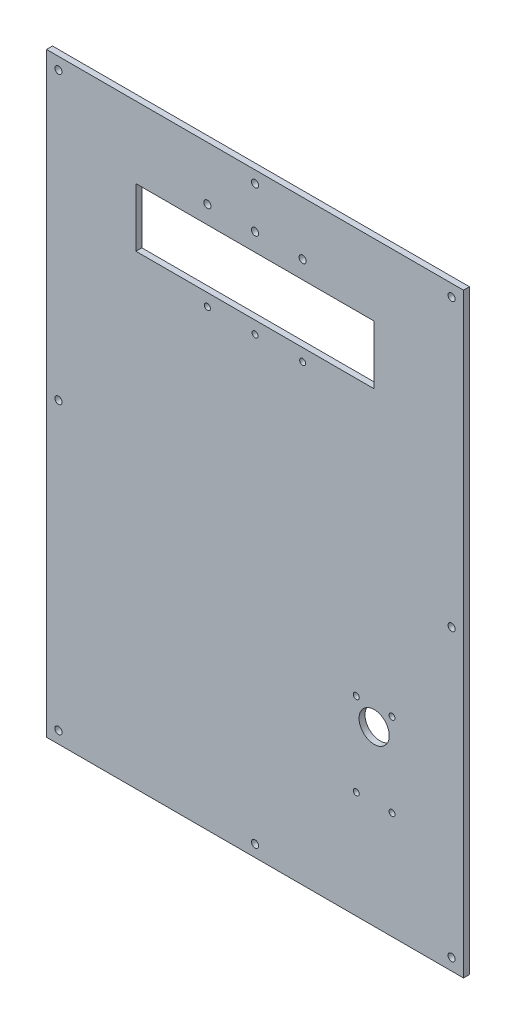
ISO-10303-21;
HEADER;
FILE_DESCRIPTION(('STEP AP214'),'2;1');
FILE_NAME('part.step','',(''),(''),'','','');
FILE_SCHEMA(('AUTOMOTIVE_DESIGN { 1 0 10303 214 1 1 1 1 }'));
ENDSEC;
DATA;
#1=APPLICATION_CONTEXT('core data for automotive mechanical design processes');
#2=APPLICATION_PROTOCOL_DEFINITION('international standard','automotive_design',2000,#1);
#3=PRODUCT_CONTEXT('',#1,'mechanical');
#4=PRODUCT('Part','Part','',(#3));
#5=PRODUCT_RELATED_PRODUCT_CATEGORY('part','',(#4));
#6=PRODUCT_DEFINITION_FORMATION('','',#4);
#7=PRODUCT_DEFINITION_CONTEXT('part definition',#1,'design');
#8=PRODUCT_DEFINITION('design','',#6,#7);
#9=PRODUCT_DEFINITION_SHAPE('','',#8);
#10=(LENGTH_UNIT() NAMED_UNIT(*) SI_UNIT(.MILLI.,.METRE.));
#11=(NAMED_UNIT(*) PLANE_ANGLE_UNIT() SI_UNIT($,.RADIAN.));
#12=(NAMED_UNIT(*) SI_UNIT($,.STERADIAN.) SOLID_ANGLE_UNIT());
#13=UNCERTAINTY_MEASURE_WITH_UNIT(LENGTH_MEASURE(1.E-05),#10,'distance_accuracy_value','');
#14=(GEOMETRIC_REPRESENTATION_CONTEXT(3) GLOBAL_UNCERTAINTY_ASSIGNED_CONTEXT((#13)) GLOBAL_UNIT_ASSIGNED_CONTEXT((#10,
#11,#12)) REPRESENTATION_CONTEXT('',''));
#15=CARTESIAN_POINT('',(0.,0.,0.));
#16=DIRECTION('',(0.,0.,1.));
#17=DIRECTION('',(1.,0.,0.));
#18=AXIS2_PLACEMENT_3D('',#15,#16,#17);
#19=CARTESIAN_POINT('',(0.,0.,5.));
#20=DIRECTION('',(0.,0.,-1.));
#21=DIRECTION('',(-1.,0.,0.));
#22=AXIS2_PLACEMENT_3D('',#19,#20,#21);
#23=PLANE('',#22);
#24=CARTESIAN_POINT('',(0.,-240.,5.));
#25=DIRECTION('',(0.,0.,1.));
#26=DIRECTION('',(1.,0.,0.));
#27=AXIS2_PLACEMENT_3D('',#24,#25,#26);
#28=CIRCLE('',#27,3.);
#29=CARTESIAN_POINT('',(3.00000000000006,-240.,5.));
#30=VERTEX_POINT('',#29);
#31=EDGE_CURVE('E140',#30,#30,#28,.T.);
#32=ORIENTED_EDGE('',*,*,#31,.F.);
#33=EDGE_LOOP('',(#32));
#34=FACE_BOUND('',#33,.T.);
#35=CARTESIAN_POINT('',(0.,240.,5.));
#36=DIRECTION('',(0.,0.,1.));
#37=DIRECTION('',(1.,0.,0.));
#38=AXIS2_PLACEMENT_3D('',#35,#36,#37);
#39=CIRCLE('',#38,3.);
#40=CARTESIAN_POINT('',(3.,240.,5.));
#41=VERTEX_POINT('',#40);
#42=EDGE_CURVE('E146',#41,#41,#39,.T.);
#43=ORIENTED_EDGE('',*,*,#42,.F.);
#44=EDGE_LOOP('',(#43));
#45=FACE_BOUND('',#44,.T.);
#46=CARTESIAN_POINT('',(165.,240.,5.));
#47=DIRECTION('',(0.,0.,1.));
#48=DIRECTION('',(-1.,0.,0.));
#49=AXIS2_PLACEMENT_3D('',#46,#47,#48);
#50=CIRCLE('',#49,2.99999999999999);
#51=CARTESIAN_POINT('',(162.,240.,5.));
#52=VERTEX_POINT('',#51);
#53=EDGE_CURVE('E152',#52,#52,#50,.T.);
#54=ORIENTED_EDGE('',*,*,#53,.F.);
#55=EDGE_LOOP('',(#54));
#56=FACE_BOUND('',#55,.T.);
#57=CARTESIAN_POINT('',(165.,0.,5.));
#58=DIRECTION('',(0.,0.,1.));
#59=DIRECTION('',(-1.,0.,0.));
#60=AXIS2_PLACEMENT_3D('',#57,#58,#59);
#61=CIRCLE('',#60,2.99999999999999);
#62=CARTESIAN_POINT('',(162.,0.,5.));
#63=VERTEX_POINT('',#62);
#64=EDGE_CURVE('E158',#63,#63,#61,.T.);
#65=ORIENTED_EDGE('',*,*,#64,.F.);
#66=EDGE_LOOP('',(#65));
#67=FACE_BOUND('',#66,.T.);
#68=CARTESIAN_POINT('',(165.,-240.,5.));
#69=DIRECTION('',(0.,0.,1.));
#70=DIRECTION('',(-1.,0.,0.));
#71=AXIS2_PLACEMENT_3D('',#68,#69,#70);
#72=CIRCLE('',#71,2.99999999999999);
#73=CARTESIAN_POINT('',(162.,-240.,5.));
#74=VERTEX_POINT('',#73);
#75=EDGE_CURVE('E164',#74,#74,#72,.T.);
#76=ORIENTED_EDGE('',*,*,#75,.F.);
#77=EDGE_LOOP('',(#76));
#78=FACE_BOUND('',#77,.T.);
#79=CARTESIAN_POINT('',(-165.,0.,5.));
#80=DIRECTION('',(0.,0.,1.));
#81=DIRECTION('',(1.,0.,0.));
#82=AXIS2_PLACEMENT_3D('',#79,#80,#81);
#83=CIRCLE('',#82,2.99999999999999);
#84=CARTESIAN_POINT('',(-162.,0.,5.));
#85=VERTEX_POINT('',#84);
#86=EDGE_CURVE('E170',#85,#85,#83,.T.);
#87=ORIENTED_EDGE('',*,*,#86,.F.);
#88=EDGE_LOOP('',(#87));
#89=FACE_BOUND('',#88,.T.);
#90=CARTESIAN_POINT('',(-165.,-240.,5.));
#91=DIRECTION('',(0.,0.,1.));
#92=DIRECTION('',(1.,0.,0.));
#93=AXIS2_PLACEMENT_3D('',#90,#91,#92);
#94=CIRCLE('',#93,2.99999999999999);
#95=CARTESIAN_POINT('',(-162.,-240.,5.));
#96=VERTEX_POINT('',#95);
#97=EDGE_CURVE('E176',#96,#96,#94,.T.);
#98=ORIENTED_EDGE('',*,*,#97,.F.);
#99=EDGE_LOOP('',(#98));
#100=FACE_BOUND('',#99,.T.);
#101=CARTESIAN_POINT('',(-165.,240.,5.));
#102=DIRECTION('',(0.,0.,1.));
#103=DIRECTION('',(1.,0.,0.));
#104=AXIS2_PLACEMENT_3D('',#101,#102,#103);
#105=CIRCLE('',#104,2.99999999999999);
#106=CARTESIAN_POINT('',(-162.,240.,5.));
#107=VERTEX_POINT('',#106);
#108=EDGE_CURVE('E182',#107,#107,#105,.T.);
#109=ORIENTED_EDGE('',*,*,#108,.F.);
#110=EDGE_LOOP('',(#109));
#111=FACE_BOUND('',#110,.T.);
#112=DIRECTION('',(0.,1.,0.));
#113=VECTOR('',#112,1.);
#114=CARTESIAN_POINT('',(175.,-250.,5.));
#115=LINE('',#114,#113);
#116=CARTESIAN_POINT('',(175.,-250.,5.));
#117=VERTEX_POINT('',#116);
#118=CARTESIAN_POINT('',(175.,250.,5.));
#119=VERTEX_POINT('',#118);
#120=EDGE_CURVE('E188',#117,#119,#115,.T.);
#121=ORIENTED_EDGE('',*,*,#120,.T.);
#122=DIRECTION('',(-1.,0.,0.));
#123=VECTOR('',#122,1.);
#124=CARTESIAN_POINT('',(-175.,250.,5.));
#125=LINE('',#124,#123);
#126=CARTESIAN_POINT('',(-175.,250.,5.));
#127=VERTEX_POINT('',#126);
#128=EDGE_CURVE('E191',#119,#127,#125,.T.);
#129=ORIENTED_EDGE('',*,*,#128,.T.);
#130=DIRECTION('',(0.,-1.,0.));
#131=VECTOR('',#130,1.);
#132=CARTESIAN_POINT('',(-175.,-250.,5.));
#133=LINE('',#132,#131);
#134=CARTESIAN_POINT('',(-175.,-250.,5.));
#135=VERTEX_POINT('',#134);
#136=EDGE_CURVE('E194',#127,#135,#133,.T.);
#137=ORIENTED_EDGE('',*,*,#136,.T.);
#138=DIRECTION('',(1.,0.,0.));
#139=VECTOR('',#138,1.);
#140=CARTESIAN_POINT('',(-175.,-250.,5.));
#141=LINE('',#140,#139);
#142=EDGE_CURVE('E196',#135,#117,#141,.T.);
#143=ORIENTED_EDGE('',*,*,#142,.T.);
#144=EDGE_LOOP('',(#121,#129,#137,#143));
#145=FACE_BOUND('',#144,.T.);
#146=DIRECTION('',(0.,-1.,0.));
#147=VECTOR('',#146,1.);
#148=CARTESIAN_POINT('',(-100.,190.,5.));
#149=LINE('',#148,#147);
#150=CARTESIAN_POINT('',(-100.,190.,5.));
#151=VERTEX_POINT('',#150);
#152=CARTESIAN_POINT('',(-100.,140.8,5.));
#153=VERTEX_POINT('',#152);
#154=EDGE_CURVE('E101',#151,#153,#149,.T.);
#155=ORIENTED_EDGE('',*,*,#154,.F.);
#156=DIRECTION('',(-1.,0.,0.));
#157=VECTOR('',#156,1.);
#158=CARTESIAN_POINT('',(100.,190.,5.));
#159=LINE('',#158,#157);
#160=CARTESIAN_POINT('',(100.,190.,5.));
#161=VERTEX_POINT('',#160);
#162=EDGE_CURVE('E124',#161,#151,#159,.T.);
#163=ORIENTED_EDGE('',*,*,#162,.F.);
#164=DIRECTION('',(0.,1.,0.));
#165=VECTOR('',#164,1.);
#166=CARTESIAN_POINT('',(100.,190.,5.));
#167=LINE('',#166,#165);
#168=CARTESIAN_POINT('',(100.,140.8,5.));
#169=VERTEX_POINT('',#168);
#170=EDGE_CURVE('E122',#169,#161,#167,.T.);
#171=ORIENTED_EDGE('',*,*,#170,.F.);
#172=DIRECTION('',(1.,0.,0.));
#173=VECTOR('',#172,1.);
#174=CARTESIAN_POINT('',(100.,140.8,5.));
#175=LINE('',#174,#173);
#176=EDGE_CURVE('E109',#153,#169,#175,.T.);
#177=ORIENTED_EDGE('',*,*,#176,.F.);
#178=EDGE_LOOP('',(#155,#163,#171,#177));
#179=FACE_BOUND('',#178,.T.);
#180=CARTESIAN_POINT('',(40.,205.,5.));
#181=DIRECTION('',(0.,0.,1.));
#182=DIRECTION('',(1.,0.,0.));
#183=AXIS2_PLACEMENT_3D('',#180,#181,#182);
#184=CIRCLE('',#183,3.00000000000001);
#185=CARTESIAN_POINT('',(43.,205.,5.));
#186=VERTEX_POINT('',#185);
#187=EDGE_CURVE('E130',#186,#186,#184,.T.);
#188=ORIENTED_EDGE('',*,*,#187,.F.);
#189=EDGE_LOOP('',(#188));
#190=FACE_BOUND('',#189,.T.);
#191=CARTESIAN_POINT('',(0.,205.,5.));
#192=DIRECTION('',(0.,0.,1.));
#193=DIRECTION('',(1.,0.,0.));
#194=AXIS2_PLACEMENT_3D('',#191,#192,#193);
#195=CIRCLE('',#194,3.);
#196=CARTESIAN_POINT('',(3.,205.,5.));
#197=VERTEX_POINT('',#196);
#198=EDGE_CURVE('E343',#197,#197,#195,.T.);
#199=ORIENTED_EDGE('',*,*,#198,.F.);
#200=EDGE_LOOP('',(#199));
#201=FACE_BOUND('',#200,.T.);
#202=CARTESIAN_POINT('',(-40.,205.,5.));
#203=DIRECTION('',(0.,0.,1.));
#204=DIRECTION('',(-1.,0.,0.));
#205=AXIS2_PLACEMENT_3D('',#202,#203,#204);
#206=CIRCLE('',#205,3.00000000000001);
#207=CARTESIAN_POINT('',(-43.,205.,5.));
#208=VERTEX_POINT('',#207);
#209=EDGE_CURVE('E338',#208,#208,#206,.T.);
#210=ORIENTED_EDGE('',*,*,#209,.F.);
#211=EDGE_LOOP('',(#210));
#212=FACE_BOUND('',#211,.T.);
#213=CARTESIAN_POINT('',(0.,130.4,5.));
#214=DIRECTION('',(0.,0.,1.));
#215=DIRECTION('',(1.,0.,0.));
#216=AXIS2_PLACEMENT_3D('',#213,#214,#215);
#217=CIRCLE('',#216,2.5);
#218=CARTESIAN_POINT('',(2.5,130.4,5.));
#219=VERTEX_POINT('',#218);
#220=EDGE_CURVE('E333',#219,#219,#217,.T.);
#221=ORIENTED_EDGE('',*,*,#220,.F.);
#222=EDGE_LOOP('',(#221));
#223=FACE_BOUND('',#222,.T.);
#224=CARTESIAN_POINT('',(40.,130.4,5.));
#225=DIRECTION('',(0.,0.,1.));
#226=DIRECTION('',(1.,0.,0.));
#227=AXIS2_PLACEMENT_3D('',#224,#225,#226);
#228=CIRCLE('',#227,2.5);
#229=CARTESIAN_POINT('',(42.5,130.4,5.));
#230=VERTEX_POINT('',#229);
#231=EDGE_CURVE('E328',#230,#230,#228,.T.);
#232=ORIENTED_EDGE('',*,*,#231,.F.);
#233=EDGE_LOOP('',(#232));
#234=FACE_BOUND('',#233,.T.);
#235=CARTESIAN_POINT('',(-40.,130.4,5.));
#236=DIRECTION('',(0.,0.,1.));
#237=DIRECTION('',(-1.,0.,0.));
#238=AXIS2_PLACEMENT_3D('',#235,#236,#237);
#239=CIRCLE('',#238,2.5);
#240=CARTESIAN_POINT('',(-42.5,130.4,5.));
#241=VERTEX_POINT('',#240);
#242=EDGE_CURVE('E323',#241,#241,#239,.T.);
#243=ORIENTED_EDGE('',*,*,#242,.F.);
#244=EDGE_LOOP('',(#243));
#245=FACE_BOUND('',#244,.T.);
#246=CARTESIAN_POINT('',(115.,-90.0000000000001,5.));
#247=DIRECTION('',(0.,0.,1.));
#248=DIRECTION('',(1.,0.,0.));
#249=AXIS2_PLACEMENT_3D('',#246,#247,#248);
#250=CIRCLE('',#249,2.50000000000001);
#251=CARTESIAN_POINT('',(117.5,-90.0000000000001,5.));
#252=VERTEX_POINT('',#251);
#253=EDGE_CURVE('E318',#252,#252,#250,.T.);
#254=ORIENTED_EDGE('',*,*,#253,.F.);
#255=EDGE_LOOP('',(#254));
#256=FACE_BOUND('',#255,.T.);
#257=CARTESIAN_POINT('',(85.0000000000001,-90.0000000000001,5.));
#258=DIRECTION('',(0.,0.,1.));
#259=DIRECTION('',(1.,0.,0.));
#260=AXIS2_PLACEMENT_3D('',#257,#258,#259);
#261=CIRCLE('',#260,2.50000000000001);
#262=CARTESIAN_POINT('',(87.5000000000001,-90.0000000000001,5.));
#263=VERTEX_POINT('',#262);
#264=EDGE_CURVE('E313',#263,#263,#261,.T.);
#265=ORIENTED_EDGE('',*,*,#264,.F.);
#266=EDGE_LOOP('',(#265));
#267=FACE_BOUND('',#266,.T.);
#268=CARTESIAN_POINT('',(115.,-160.,5.));
#269=DIRECTION('',(0.,0.,1.));
#270=DIRECTION('',(1.,0.,0.));
#271=AXIS2_PLACEMENT_3D('',#268,#269,#270);
#272=CIRCLE('',#271,2.50000000000001);
#273=CARTESIAN_POINT('',(117.5,-160.,5.));
#274=VERTEX_POINT('',#273);
#275=EDGE_CURVE('E308',#274,#274,#272,.T.);
#276=ORIENTED_EDGE('',*,*,#275,.F.);
#277=EDGE_LOOP('',(#276));
#278=FACE_BOUND('',#277,.T.);
#279=CARTESIAN_POINT('',(85.0000000000001,-160.,5.));
#280=DIRECTION('',(0.,0.,1.));
#281=DIRECTION('',(1.,0.,0.));
#282=AXIS2_PLACEMENT_3D('',#279,#280,#281);
#283=CIRCLE('',#282,2.5);
#284=CARTESIAN_POINT('',(87.5000000000001,-160.,5.));
#285=VERTEX_POINT('',#284);
#286=EDGE_CURVE('E303',#285,#285,#283,.T.);
#287=ORIENTED_EDGE('',*,*,#286,.F.);
#288=EDGE_LOOP('',(#287));
#289=FACE_BOUND('',#288,.T.);
#290=CARTESIAN_POINT('',(100.,-105.,5.));
#291=DIRECTION('',(0.,0.,1.));
#292=DIRECTION('',(1.,0.,0.));
#293=AXIS2_PLACEMENT_3D('',#290,#291,#292);
#294=CIRCLE('',#293,12.665);
#295=CARTESIAN_POINT('',(112.665,-105.,5.));
#296=VERTEX_POINT('',#295);
#297=EDGE_CURVE('E297',#296,#296,#294,.T.);
#298=ORIENTED_EDGE('',*,*,#297,.F.);
#299=EDGE_LOOP('',(#298));
#300=FACE_BOUND('',#299,.T.);
#301=ADVANCED_FACE('F36',(#34,#45,#56,#67,#78,#89,#100,#111,#145,#179,#190,#201,#212,#223,#234,
#245,#256,#267,#278,#289,#300),#23,.F.);
#302=CARTESIAN_POINT('',(0.,0.,0.));
#303=DIRECTION('',(0.,0.,-1.));
#304=DIRECTION('',(-1.,0.,0.));
#305=AXIS2_PLACEMENT_3D('',#302,#303,#304);
#306=PLANE('',#305);
#307=CARTESIAN_POINT('',(85.0000000000001,-160.,0.));
#308=DIRECTION('',(0.,0.,1.));
#309=DIRECTION('',(1.,0.,0.));
#310=AXIS2_PLACEMENT_3D('',#307,#308,#309);
#311=CIRCLE('',#310,2.5);
#312=CARTESIAN_POINT('',(87.5000000000001,-160.,0.));
#313=VERTEX_POINT('',#312);
#314=EDGE_CURVE('E300',#313,#313,#311,.T.);
#315=ORIENTED_EDGE('',*,*,#314,.T.);
#316=EDGE_LOOP('',(#315));
#317=FACE_BOUND('',#316,.T.);
#318=CARTESIAN_POINT('',(85.0000000000001,-90.0000000000001,0.));
#319=DIRECTION('',(0.,0.,1.));
#320=DIRECTION('',(1.,0.,0.));
#321=AXIS2_PLACEMENT_3D('',#318,#319,#320);
#322=CIRCLE('',#321,2.50000000000001);
#323=CARTESIAN_POINT('',(87.5000000000001,-90.0000000000001,0.));
#324=VERTEX_POINT('',#323);
#325=EDGE_CURVE('E311',#324,#324,#322,.T.);
#326=ORIENTED_EDGE('',*,*,#325,.T.);
#327=EDGE_LOOP('',(#326));
#328=FACE_BOUND('',#327,.T.);
#329=CARTESIAN_POINT('',(-40.,130.4,0.));
#330=DIRECTION('',(0.,0.,1.));
#331=DIRECTION('',(-1.,0.,0.));
#332=AXIS2_PLACEMENT_3D('',#329,#330,#331);
#333=CIRCLE('',#332,2.5);
#334=CARTESIAN_POINT('',(-42.5,130.4,0.));
#335=VERTEX_POINT('',#334);
#336=EDGE_CURVE('E321',#335,#335,#333,.T.);
#337=ORIENTED_EDGE('',*,*,#336,.T.);
#338=EDGE_LOOP('',(#337));
#339=FACE_BOUND('',#338,.T.);
#340=CARTESIAN_POINT('',(0.,130.4,0.));
#341=DIRECTION('',(0.,0.,1.));
#342=DIRECTION('',(1.,0.,0.));
#343=AXIS2_PLACEMENT_3D('',#340,#341,#342);
#344=CIRCLE('',#343,2.5);
#345=CARTESIAN_POINT('',(2.5,130.4,0.));
#346=VERTEX_POINT('',#345);
#347=EDGE_CURVE('E331',#346,#346,#344,.T.);
#348=ORIENTED_EDGE('',*,*,#347,.T.);
#349=EDGE_LOOP('',(#348));
#350=FACE_BOUND('',#349,.T.);
#351=CARTESIAN_POINT('',(0.,205.,0.));
#352=DIRECTION('',(0.,0.,1.));
#353=DIRECTION('',(1.,0.,0.));
#354=AXIS2_PLACEMENT_3D('',#351,#352,#353);
#355=CIRCLE('',#354,3.);
#356=CARTESIAN_POINT('',(3.,205.,0.));
#357=VERTEX_POINT('',#356);
#358=EDGE_CURVE('E341',#357,#357,#355,.T.);
#359=ORIENTED_EDGE('',*,*,#358,.T.);
#360=EDGE_LOOP('',(#359));
#361=FACE_BOUND('',#360,.T.);
#362=DIRECTION('',(-1.,0.,0.));
#363=VECTOR('',#362,1.);
#364=CARTESIAN_POINT('',(100.,190.,0.));
#365=LINE('',#364,#363);
#366=CARTESIAN_POINT('',(100.,190.,0.));
#367=VERTEX_POINT('',#366);
#368=CARTESIAN_POINT('',(-100.,190.,0.));
#369=VERTEX_POINT('',#368);
#370=EDGE_CURVE('E110',#367,#369,#365,.T.);
#371=ORIENTED_EDGE('',*,*,#370,.T.);
#372=DIRECTION('',(0.,-1.,0.));
#373=VECTOR('',#372,1.);
#374=CARTESIAN_POINT('',(-100.,190.,0.));
#375=LINE('',#374,#373);
#376=CARTESIAN_POINT('',(-100.,140.8,0.));
#377=VERTEX_POINT('',#376);
#378=EDGE_CURVE('E59',#369,#377,#375,.T.);
#379=ORIENTED_EDGE('',*,*,#378,.T.);
#380=DIRECTION('',(1.,0.,0.));
#381=VECTOR('',#380,1.);
#382=CARTESIAN_POINT('',(100.,140.8,0.));
#383=LINE('',#382,#381);
#384=CARTESIAN_POINT('',(100.,140.8,0.));
#385=VERTEX_POINT('',#384);
#386=EDGE_CURVE('E116',#377,#385,#383,.T.);
#387=ORIENTED_EDGE('',*,*,#386,.T.);
#388=DIRECTION('',(0.,1.,0.));
#389=VECTOR('',#388,1.);
#390=CARTESIAN_POINT('',(100.,190.,0.));
#391=LINE('',#390,#389);
#392=EDGE_CURVE('E132',#385,#367,#391,.T.);
#393=ORIENTED_EDGE('',*,*,#392,.T.);
#394=EDGE_LOOP('',(#371,#379,#387,#393));
#395=FACE_BOUND('',#394,.T.);
#396=CARTESIAN_POINT('',(0.,-240.,0.));
#397=DIRECTION('',(0.,0.,1.));
#398=DIRECTION('',(1.,0.,0.));
#399=AXIS2_PLACEMENT_3D('',#396,#397,#398);
#400=CIRCLE('',#399,3.);
#401=CARTESIAN_POINT('',(3.00000000000006,-240.,0.));
#402=VERTEX_POINT('',#401);
#403=EDGE_CURVE('E117',#402,#402,#400,.T.);
#404=ORIENTED_EDGE('',*,*,#403,.T.);
#405=EDGE_LOOP('',(#404));
#406=FACE_BOUND('',#405,.T.);
#407=CARTESIAN_POINT('',(165.,240.,0.));
#408=DIRECTION('',(0.,0.,1.));
#409=DIRECTION('',(-1.,0.,0.));
#410=AXIS2_PLACEMENT_3D('',#407,#408,#409);
#411=CIRCLE('',#410,2.99999999999999);
#412=CARTESIAN_POINT('',(162.,240.,0.));
#413=VERTEX_POINT('',#412);
#414=EDGE_CURVE('E149',#413,#413,#411,.T.);
#415=ORIENTED_EDGE('',*,*,#414,.T.);
#416=EDGE_LOOP('',(#415));
#417=FACE_BOUND('',#416,.T.);
#418=CARTESIAN_POINT('',(165.,-240.,0.));
#419=DIRECTION('',(0.,0.,1.));
#420=DIRECTION('',(-1.,0.,0.));
#421=AXIS2_PLACEMENT_3D('',#418,#419,#420);
#422=CIRCLE('',#421,2.99999999999999);
#423=CARTESIAN_POINT('',(162.,-240.,0.));
#424=VERTEX_POINT('',#423);
#425=EDGE_CURVE('E161',#424,#424,#422,.T.);
#426=ORIENTED_EDGE('',*,*,#425,.T.);
#427=EDGE_LOOP('',(#426));
#428=FACE_BOUND('',#427,.T.);
#429=CARTESIAN_POINT('',(-165.,-240.,0.));
#430=DIRECTION('',(0.,0.,1.));
#431=DIRECTION('',(1.,0.,0.));
#432=AXIS2_PLACEMENT_3D('',#429,#430,#431);
#433=CIRCLE('',#432,2.99999999999999);
#434=CARTESIAN_POINT('',(-162.,-240.,0.));
#435=VERTEX_POINT('',#434);
#436=EDGE_CURVE('E173',#435,#435,#433,.T.);
#437=ORIENTED_EDGE('',*,*,#436,.T.);
#438=EDGE_LOOP('',(#437));
#439=FACE_BOUND('',#438,.T.);
#440=DIRECTION('',(0.,1.,0.));
#441=VECTOR('',#440,1.);
#442=CARTESIAN_POINT('',(175.,-250.,0.));
#443=LINE('',#442,#441);
#444=CARTESIAN_POINT('',(175.,-250.,0.));
#445=VERTEX_POINT('',#444);
#446=CARTESIAN_POINT('',(175.,250.,0.));
#447=VERTEX_POINT('',#446);
#448=EDGE_CURVE('E185',#445,#447,#443,.T.);
#449=ORIENTED_EDGE('',*,*,#448,.F.);
#450=DIRECTION('',(1.,0.,0.));
#451=VECTOR('',#450,1.);
#452=CARTESIAN_POINT('',(-175.,-250.,0.));
#453=LINE('',#452,#451);
#454=CARTESIAN_POINT('',(-175.,-250.,0.));
#455=VERTEX_POINT('',#454);
#456=EDGE_CURVE('E192',#455,#445,#453,.T.);
#457=ORIENTED_EDGE('',*,*,#456,.F.);
#458=DIRECTION('',(0.,-1.,0.));
#459=VECTOR('',#458,1.);
#460=CARTESIAN_POINT('',(-175.,-250.,0.));
#461=LINE('',#460,#459);
#462=CARTESIAN_POINT('',(-175.,250.,0.));
#463=VERTEX_POINT('',#462);
#464=EDGE_CURVE('E203',#463,#455,#461,.T.);
#465=ORIENTED_EDGE('',*,*,#464,.F.);
#466=DIRECTION('',(-1.,0.,0.));
#467=VECTOR('',#466,1.);
#468=CARTESIAN_POINT('',(-175.,250.,0.));
#469=LINE('',#468,#467);
#470=EDGE_CURVE('E201',#447,#463,#469,.T.);
#471=ORIENTED_EDGE('',*,*,#470,.F.);
#472=EDGE_LOOP('',(#449,#457,#465,#471));
#473=FACE_BOUND('',#472,.T.);
#474=CARTESIAN_POINT('',(-165.,240.,0.));
#475=DIRECTION('',(0.,0.,1.));
#476=DIRECTION('',(1.,0.,0.));
#477=AXIS2_PLACEMENT_3D('',#474,#475,#476);
#478=CIRCLE('',#477,2.99999999999999);
#479=CARTESIAN_POINT('',(-162.,240.,0.));
#480=VERTEX_POINT('',#479);
#481=EDGE_CURVE('E179',#480,#480,#478,.T.);
#482=ORIENTED_EDGE('',*,*,#481,.T.);
#483=EDGE_LOOP('',(#482));
#484=FACE_BOUND('',#483,.T.);
#485=CARTESIAN_POINT('',(-165.,0.,0.));
#486=DIRECTION('',(0.,0.,1.));
#487=DIRECTION('',(1.,0.,0.));
#488=AXIS2_PLACEMENT_3D('',#485,#486,#487);
#489=CIRCLE('',#488,2.99999999999999);
#490=CARTESIAN_POINT('',(-162.,0.,0.));
#491=VERTEX_POINT('',#490);
#492=EDGE_CURVE('E167',#491,#491,#489,.T.);
#493=ORIENTED_EDGE('',*,*,#492,.T.);
#494=EDGE_LOOP('',(#493));
#495=FACE_BOUND('',#494,.T.);
#496=CARTESIAN_POINT('',(165.,0.,0.));
#497=DIRECTION('',(0.,0.,1.));
#498=DIRECTION('',(-1.,0.,0.));
#499=AXIS2_PLACEMENT_3D('',#496,#497,#498);
#500=CIRCLE('',#499,2.99999999999999);
#501=CARTESIAN_POINT('',(162.,0.,0.));
#502=VERTEX_POINT('',#501);
#503=EDGE_CURVE('E155',#502,#502,#500,.T.);
#504=ORIENTED_EDGE('',*,*,#503,.T.);
#505=EDGE_LOOP('',(#504));
#506=FACE_BOUND('',#505,.T.);
#507=CARTESIAN_POINT('',(0.,240.,0.));
#508=DIRECTION('',(0.,0.,1.));
#509=DIRECTION('',(1.,0.,0.));
#510=AXIS2_PLACEMENT_3D('',#507,#508,#509);
#511=CIRCLE('',#510,3.);
#512=CARTESIAN_POINT('',(3.,240.,0.));
#513=VERTEX_POINT('',#512);
#514=EDGE_CURVE('E143',#513,#513,#511,.T.);
#515=ORIENTED_EDGE('',*,*,#514,.T.);
#516=EDGE_LOOP('',(#515));
#517=FACE_BOUND('',#516,.T.);
#518=CARTESIAN_POINT('',(40.,205.,0.));
#519=DIRECTION('',(0.,0.,1.));
#520=DIRECTION('',(1.,0.,0.));
#521=AXIS2_PLACEMENT_3D('',#518,#519,#520);
#522=CIRCLE('',#521,3.00000000000001);
#523=CARTESIAN_POINT('',(43.,205.,0.));
#524=VERTEX_POINT('',#523);
#525=EDGE_CURVE('E276',#524,#524,#522,.T.);
#526=ORIENTED_EDGE('',*,*,#525,.T.);
#527=EDGE_LOOP('',(#526));
#528=FACE_BOUND('',#527,.T.);
#529=CARTESIAN_POINT('',(-40.,205.,0.));
#530=DIRECTION('',(0.,0.,1.));
#531=DIRECTION('',(-1.,0.,0.));
#532=AXIS2_PLACEMENT_3D('',#529,#530,#531);
#533=CIRCLE('',#532,3.00000000000001);
#534=CARTESIAN_POINT('',(-43.,205.,0.));
#535=VERTEX_POINT('',#534);
#536=EDGE_CURVE('E280',#535,#535,#533,.T.);
#537=ORIENTED_EDGE('',*,*,#536,.T.);
#538=EDGE_LOOP('',(#537));
#539=FACE_BOUND('',#538,.T.);
#540=CARTESIAN_POINT('',(40.,130.4,0.));
#541=DIRECTION('',(0.,0.,1.));
#542=DIRECTION('',(1.,0.,0.));
#543=AXIS2_PLACEMENT_3D('',#540,#541,#542);
#544=CIRCLE('',#543,2.5);
#545=CARTESIAN_POINT('',(42.5,130.4,0.));
#546=VERTEX_POINT('',#545);
#547=EDGE_CURVE('E284',#546,#546,#544,.T.);
#548=ORIENTED_EDGE('',*,*,#547,.T.);
#549=EDGE_LOOP('',(#548));
#550=FACE_BOUND('',#549,.T.);
#551=CARTESIAN_POINT('',(115.,-90.0000000000001,0.));
#552=DIRECTION('',(0.,0.,1.));
#553=DIRECTION('',(1.,0.,0.));
#554=AXIS2_PLACEMENT_3D('',#551,#552,#553);
#555=CIRCLE('',#554,2.50000000000001);
#556=CARTESIAN_POINT('',(117.5,-90.0000000000001,0.));
#557=VERTEX_POINT('',#556);
#558=EDGE_CURVE('E288',#557,#557,#555,.T.);
#559=ORIENTED_EDGE('',*,*,#558,.T.);
#560=EDGE_LOOP('',(#559));
#561=FACE_BOUND('',#560,.T.);
#562=CARTESIAN_POINT('',(115.,-160.,0.));
#563=DIRECTION('',(0.,0.,1.));
#564=DIRECTION('',(1.,0.,0.));
#565=AXIS2_PLACEMENT_3D('',#562,#563,#564);
#566=CIRCLE('',#565,2.50000000000001);
#567=CARTESIAN_POINT('',(117.5,-160.,0.));
#568=VERTEX_POINT('',#567);
#569=EDGE_CURVE('E292',#568,#568,#566,.T.);
#570=ORIENTED_EDGE('',*,*,#569,.T.);
#571=EDGE_LOOP('',(#570));
#572=FACE_BOUND('',#571,.T.);
#573=CARTESIAN_POINT('',(100.,-105.,0.));
#574=DIRECTION('',(0.,0.,1.));
#575=DIRECTION('',(1.,0.,0.));
#576=AXIS2_PLACEMENT_3D('',#573,#574,#575);
#577=CIRCLE('',#576,12.665);
#578=CARTESIAN_POINT('',(112.665,-105.,0.));
#579=VERTEX_POINT('',#578);
#580=EDGE_CURVE('E295',#579,#579,#577,.T.);
#581=ORIENTED_EDGE('',*,*,#580,.T.);
#582=EDGE_LOOP('',(#581));
#583=FACE_BOUND('',#582,.T.);
#584=ADVANCED_FACE('F221',(#317,#328,#339,#350,#361,#395,#406,#417,#428,#439,#473,#484,#495,
#506,#517,#528,#539,#550,#561,#572,#583),#306,.T.);
#585=CARTESIAN_POINT('',(175.,-250.,5.));
#586=DIRECTION('',(-1.,0.,0.));
#587=DIRECTION('',(0.,-1.,0.));
#588=AXIS2_PLACEMENT_3D('',#585,#586,#587);
#589=PLANE('',#588);
#590=ORIENTED_EDGE('',*,*,#448,.T.);
#591=DIRECTION('',(0.,0.,-1.));
#592=VECTOR('',#591,1.);
#593=CARTESIAN_POINT('',(175.,250.,5.));
#594=LINE('',#593,#592);
#595=EDGE_CURVE('E11',#119,#447,#594,.T.);
#596=ORIENTED_EDGE('',*,*,#595,.F.);
#597=ORIENTED_EDGE('',*,*,#120,.F.);
#598=DIRECTION('',(0.,0.,-1.));
#599=VECTOR('',#598,1.);
#600=CARTESIAN_POINT('',(175.,-250.,5.));
#601=LINE('',#600,#599);
#602=EDGE_CURVE('E198',#117,#445,#601,.T.);
#603=ORIENTED_EDGE('',*,*,#602,.T.);
#604=EDGE_LOOP('',(#590,#596,#597,#603));
#605=FACE_BOUND('',#604,.T.);
#606=ADVANCED_FACE('F38',(#605),#589,.F.);
#607=CARTESIAN_POINT('',(-175.,250.,5.));
#608=DIRECTION('',(0.,-1.,0.));
#609=DIRECTION('',(1.,0.,0.));
#610=AXIS2_PLACEMENT_3D('',#607,#608,#609);
#611=PLANE('',#610);
#612=ORIENTED_EDGE('',*,*,#470,.T.);
#613=DIRECTION('',(0.,0.,-1.));
#614=VECTOR('',#613,1.);
#615=CARTESIAN_POINT('',(-175.,250.,5.));
#616=LINE('',#615,#614);
#617=EDGE_CURVE('E44',#127,#463,#616,.T.);
#618=ORIENTED_EDGE('',*,*,#617,.F.);
#619=ORIENTED_EDGE('',*,*,#128,.F.);
#620=ORIENTED_EDGE('',*,*,#595,.T.);
#621=EDGE_LOOP('',(#612,#618,#619,#620));
#622=FACE_BOUND('',#621,.T.);
#623=ADVANCED_FACE('F231',(#622),#611,.F.);
#624=CARTESIAN_POINT('',(-175.,-250.,5.));
#625=DIRECTION('',(1.,0.,0.));
#626=DIRECTION('',(0.,0.,-1.));
#627=AXIS2_PLACEMENT_3D('',#624,#625,#626);
#628=PLANE('',#627);
#629=ORIENTED_EDGE('',*,*,#464,.T.);
#630=DIRECTION('',(0.,0.,-1.));
#631=VECTOR('',#630,1.);
#632=CARTESIAN_POINT('',(-175.,-250.,5.));
#633=LINE('',#632,#631);
#634=EDGE_CURVE('E208',#135,#455,#633,.T.);
#635=ORIENTED_EDGE('',*,*,#634,.F.);
#636=ORIENTED_EDGE('',*,*,#136,.F.);
#637=ORIENTED_EDGE('',*,*,#617,.T.);
#638=EDGE_LOOP('',(#629,#635,#636,#637));
#639=FACE_BOUND('',#638,.T.);
#640=ADVANCED_FACE('F215',(#639),#628,.F.);
#641=CARTESIAN_POINT('',(-175.,-250.,5.));
#642=DIRECTION('',(0.,1.,0.));
#643=DIRECTION('',(-1.,0.,0.));
#644=AXIS2_PLACEMENT_3D('',#641,#642,#643);
#645=PLANE('',#644);
#646=ORIENTED_EDGE('',*,*,#456,.T.);
#647=ORIENTED_EDGE('',*,*,#602,.F.);
#648=ORIENTED_EDGE('',*,*,#142,.F.);
#649=ORIENTED_EDGE('',*,*,#634,.T.);
#650=EDGE_LOOP('',(#646,#647,#648,#649));
#651=FACE_BOUND('',#650,.T.);
#652=ADVANCED_FACE('F225',(#651),#645,.F.);
#653=CARTESIAN_POINT('',(-165.,240.,5.));
#654=DIRECTION('',(0.,0.,-1.));
#655=DIRECTION('',(-1.,0.,0.));
#656=AXIS2_PLACEMENT_3D('',#653,#654,#655);
#657=CYLINDRICAL_SURFACE('',#656,2.99999999999999);
#658=ORIENTED_EDGE('',*,*,#108,.T.);
#659=EDGE_LOOP('',(#658));
#660=FACE_BOUND('',#659,.T.);
#661=ORIENTED_EDGE('',*,*,#481,.F.);
#662=EDGE_LOOP('',(#661));
#663=FACE_BOUND('',#662,.T.);
#664=ADVANCED_FACE('F249',(#660,#663),#657,.F.);
#665=CARTESIAN_POINT('',(-165.,-240.,5.));
#666=DIRECTION('',(0.,0.,-1.));
#667=DIRECTION('',(-1.,0.,0.));
#668=AXIS2_PLACEMENT_3D('',#665,#666,#667);
#669=CYLINDRICAL_SURFACE('',#668,2.99999999999999);
#670=ORIENTED_EDGE('',*,*,#97,.T.);
#671=EDGE_LOOP('',(#670));
#672=FACE_BOUND('',#671,.T.);
#673=ORIENTED_EDGE('',*,*,#436,.F.);
#674=EDGE_LOOP('',(#673));
#675=FACE_BOUND('',#674,.T.);
#676=ADVANCED_FACE('F256',(#672,#675),#669,.F.);
#677=CARTESIAN_POINT('',(-165.,0.,5.));
#678=DIRECTION('',(0.,0.,-1.));
#679=DIRECTION('',(-1.,0.,0.));
#680=AXIS2_PLACEMENT_3D('',#677,#678,#679);
#681=CYLINDRICAL_SURFACE('',#680,2.99999999999999);
#682=ORIENTED_EDGE('',*,*,#86,.T.);
#683=EDGE_LOOP('',(#682));
#684=FACE_BOUND('',#683,.T.);
#685=ORIENTED_EDGE('',*,*,#492,.F.);
#686=EDGE_LOOP('',(#685));
#687=FACE_BOUND('',#686,.T.);
#688=ADVANCED_FACE('F261',(#684,#687),#681,.F.);
#689=CARTESIAN_POINT('',(165.,-240.,5.));
#690=DIRECTION('',(0.,0.,-1.));
#691=DIRECTION('',(-1.,0.,0.));
#692=AXIS2_PLACEMENT_3D('',#689,#690,#691);
#693=CYLINDRICAL_SURFACE('',#692,2.99999999999999);
#694=ORIENTED_EDGE('',*,*,#75,.T.);
#695=EDGE_LOOP('',(#694));
#696=FACE_BOUND('',#695,.T.);
#697=ORIENTED_EDGE('',*,*,#425,.F.);
#698=EDGE_LOOP('',(#697));
#699=FACE_BOUND('',#698,.T.);
#700=ADVANCED_FACE('F444',(#696,#699),#693,.F.);
#701=CARTESIAN_POINT('',(165.,0.,5.));
#702=DIRECTION('',(0.,0.,-1.));
#703=DIRECTION('',(-1.,0.,0.));
#704=AXIS2_PLACEMENT_3D('',#701,#702,#703);
#705=CYLINDRICAL_SURFACE('',#704,2.99999999999999);
#706=ORIENTED_EDGE('',*,*,#64,.T.);
#707=EDGE_LOOP('',(#706));
#708=FACE_BOUND('',#707,.T.);
#709=ORIENTED_EDGE('',*,*,#503,.F.);
#710=EDGE_LOOP('',(#709));
#711=FACE_BOUND('',#710,.T.);
#712=ADVANCED_FACE('F440',(#708,#711),#705,.F.);
#713=CARTESIAN_POINT('',(165.,240.,5.));
#714=DIRECTION('',(0.,0.,-1.));
#715=DIRECTION('',(-1.,0.,0.));
#716=AXIS2_PLACEMENT_3D('',#713,#714,#715);
#717=CYLINDRICAL_SURFACE('',#716,2.99999999999999);
#718=ORIENTED_EDGE('',*,*,#53,.T.);
#719=EDGE_LOOP('',(#718));
#720=FACE_BOUND('',#719,.T.);
#721=ORIENTED_EDGE('',*,*,#414,.F.);
#722=EDGE_LOOP('',(#721));
#723=FACE_BOUND('',#722,.T.);
#724=ADVANCED_FACE('F436',(#720,#723),#717,.F.);
#725=CARTESIAN_POINT('',(0.,240.,5.));
#726=DIRECTION('',(0.,0.,-1.));
#727=DIRECTION('',(-1.,0.,0.));
#728=AXIS2_PLACEMENT_3D('',#725,#726,#727);
#729=CYLINDRICAL_SURFACE('',#728,3.);
#730=ORIENTED_EDGE('',*,*,#42,.T.);
#731=EDGE_LOOP('',(#730));
#732=FACE_BOUND('',#731,.T.);
#733=ORIENTED_EDGE('',*,*,#514,.F.);
#734=EDGE_LOOP('',(#733));
#735=FACE_BOUND('',#734,.T.);
#736=ADVANCED_FACE('F432',(#732,#735),#729,.F.);
#737=CARTESIAN_POINT('',(0.,-240.,5.));
#738=DIRECTION('',(0.,0.,-1.));
#739=DIRECTION('',(-1.,0.,0.));
#740=AXIS2_PLACEMENT_3D('',#737,#738,#739);
#741=CYLINDRICAL_SURFACE('',#740,3.);
#742=ORIENTED_EDGE('',*,*,#31,.T.);
#743=EDGE_LOOP('',(#742));
#744=FACE_BOUND('',#743,.T.);
#745=ORIENTED_EDGE('',*,*,#403,.F.);
#746=EDGE_LOOP('',(#745));
#747=FACE_BOUND('',#746,.T.);
#748=ADVANCED_FACE('F429',(#744,#747),#741,.F.);
#749=CARTESIAN_POINT('',(-100.,190.,5.));
#750=DIRECTION('',(1.,0.,0.));
#751=DIRECTION('',(0.,0.,-1.));
#752=AXIS2_PLACEMENT_3D('',#749,#750,#751);
#753=PLANE('',#752);
#754=ORIENTED_EDGE('',*,*,#378,.F.);
#755=DIRECTION('',(0.,0.,-1.));
#756=VECTOR('',#755,1.);
#757=CARTESIAN_POINT('',(-100.,190.,5.));
#758=LINE('',#757,#756);
#759=EDGE_CURVE('E105',#151,#369,#758,.T.);
#760=ORIENTED_EDGE('',*,*,#759,.F.);
#761=ORIENTED_EDGE('',*,*,#154,.T.);
#762=DIRECTION('',(0.,0.,-1.));
#763=VECTOR('',#762,1.);
#764=CARTESIAN_POINT('',(-100.,140.8,5.));
#765=LINE('',#764,#763);
#766=EDGE_CURVE('E104',#153,#377,#765,.T.);
#767=ORIENTED_EDGE('',*,*,#766,.T.);
#768=EDGE_LOOP('',(#754,#760,#761,#767));
#769=FACE_BOUND('',#768,.T.);
#770=ADVANCED_FACE('F103',(#769),#753,.T.);
#771=CARTESIAN_POINT('',(100.,140.8,5.));
#772=DIRECTION('',(0.,1.,0.));
#773=DIRECTION('',(-1.,0.,0.));
#774=AXIS2_PLACEMENT_3D('',#771,#772,#773);
#775=PLANE('',#774);
#776=ORIENTED_EDGE('',*,*,#386,.F.);
#777=ORIENTED_EDGE('',*,*,#766,.F.);
#778=ORIENTED_EDGE('',*,*,#176,.T.);
#779=DIRECTION('',(0.,0.,-1.));
#780=VECTOR('',#779,1.);
#781=CARTESIAN_POINT('',(100.,140.8,5.));
#782=LINE('',#781,#780);
#783=EDGE_CURVE('E118',#169,#385,#782,.T.);
#784=ORIENTED_EDGE('',*,*,#783,.T.);
#785=EDGE_LOOP('',(#776,#777,#778,#784));
#786=FACE_BOUND('',#785,.T.);
#787=ADVANCED_FACE('F113',(#786),#775,.T.);
#788=CARTESIAN_POINT('',(100.,190.,5.));
#789=DIRECTION('',(-1.,0.,0.));
#790=DIRECTION('',(0.,0.,1.));
#791=AXIS2_PLACEMENT_3D('',#788,#789,#790);
#792=PLANE('',#791);
#793=ORIENTED_EDGE('',*,*,#392,.F.);
#794=ORIENTED_EDGE('',*,*,#783,.F.);
#795=ORIENTED_EDGE('',*,*,#170,.T.);
#796=DIRECTION('',(0.,0.,-1.));
#797=VECTOR('',#796,1.);
#798=CARTESIAN_POINT('',(100.,190.,5.));
#799=LINE('',#798,#797);
#800=EDGE_CURVE('E51',#161,#367,#799,.T.);
#801=ORIENTED_EDGE('',*,*,#800,.T.);
#802=EDGE_LOOP('',(#793,#794,#795,#801));
#803=FACE_BOUND('',#802,.T.);
#804=ADVANCED_FACE('F421',(#803),#792,.T.);
#805=CARTESIAN_POINT('',(100.,190.,5.));
#806=DIRECTION('',(0.,-1.,0.));
#807=DIRECTION('',(1.,0.,0.));
#808=AXIS2_PLACEMENT_3D('',#805,#806,#807);
#809=PLANE('',#808);
#810=ORIENTED_EDGE('',*,*,#370,.F.);
#811=ORIENTED_EDGE('',*,*,#800,.F.);
#812=ORIENTED_EDGE('',*,*,#162,.T.);
#813=ORIENTED_EDGE('',*,*,#759,.T.);
#814=EDGE_LOOP('',(#810,#811,#812,#813));
#815=FACE_BOUND('',#814,.T.);
#816=ADVANCED_FACE('F418',(#815),#809,.T.);
#817=CARTESIAN_POINT('',(40.,205.,5.));
#818=DIRECTION('',(0.,0.,-1.));
#819=DIRECTION('',(-1.,0.,0.));
#820=AXIS2_PLACEMENT_3D('',#817,#818,#819);
#821=CYLINDRICAL_SURFACE('',#820,3.00000000000001);
#822=ORIENTED_EDGE('',*,*,#187,.T.);
#823=EDGE_LOOP('',(#822));
#824=FACE_BOUND('',#823,.T.);
#825=ORIENTED_EDGE('',*,*,#525,.F.);
#826=EDGE_LOOP('',(#825));
#827=FACE_BOUND('',#826,.T.);
#828=ADVANCED_FACE('F351',(#824,#827),#821,.F.);
#829=CARTESIAN_POINT('',(0.,205.,5.));
#830=DIRECTION('',(0.,0.,-1.));
#831=DIRECTION('',(-1.,0.,0.));
#832=AXIS2_PLACEMENT_3D('',#829,#830,#831);
#833=CYLINDRICAL_SURFACE('',#832,3.);
#834=ORIENTED_EDGE('',*,*,#198,.T.);
#835=EDGE_LOOP('',(#834));
#836=FACE_BOUND('',#835,.T.);
#837=ORIENTED_EDGE('',*,*,#358,.F.);
#838=EDGE_LOOP('',(#837));
#839=FACE_BOUND('',#838,.T.);
#840=ADVANCED_FACE('F411',(#836,#839),#833,.F.);
#841=CARTESIAN_POINT('',(-40.,205.,5.));
#842=DIRECTION('',(0.,0.,-1.));
#843=DIRECTION('',(-1.,0.,0.));
#844=AXIS2_PLACEMENT_3D('',#841,#842,#843);
#845=CYLINDRICAL_SURFACE('',#844,3.00000000000001);
#846=ORIENTED_EDGE('',*,*,#209,.T.);
#847=EDGE_LOOP('',(#846));
#848=FACE_BOUND('',#847,.T.);
#849=ORIENTED_EDGE('',*,*,#536,.F.);
#850=EDGE_LOOP('',(#849));
#851=FACE_BOUND('',#850,.T.);
#852=ADVANCED_FACE('F407',(#848,#851),#845,.F.);
#853=CARTESIAN_POINT('',(0.,130.4,5.));
#854=DIRECTION('',(0.,0.,-1.));
#855=DIRECTION('',(-1.,0.,0.));
#856=AXIS2_PLACEMENT_3D('',#853,#854,#855);
#857=CYLINDRICAL_SURFACE('',#856,2.5);
#858=ORIENTED_EDGE('',*,*,#220,.T.);
#859=EDGE_LOOP('',(#858));
#860=FACE_BOUND('',#859,.T.);
#861=ORIENTED_EDGE('',*,*,#347,.F.);
#862=EDGE_LOOP('',(#861));
#863=FACE_BOUND('',#862,.T.);
#864=ADVANCED_FACE('F403',(#860,#863),#857,.F.);
#865=CARTESIAN_POINT('',(40.,130.4,5.));
#866=DIRECTION('',(0.,0.,-1.));
#867=DIRECTION('',(-1.,0.,0.));
#868=AXIS2_PLACEMENT_3D('',#865,#866,#867);
#869=CYLINDRICAL_SURFACE('',#868,2.5);
#870=ORIENTED_EDGE('',*,*,#231,.T.);
#871=EDGE_LOOP('',(#870));
#872=FACE_BOUND('',#871,.T.);
#873=ORIENTED_EDGE('',*,*,#547,.F.);
#874=EDGE_LOOP('',(#873));
#875=FACE_BOUND('',#874,.T.);
#876=ADVANCED_FACE('F399',(#872,#875),#869,.F.);
#877=CARTESIAN_POINT('',(-40.,130.4,5.));
#878=DIRECTION('',(0.,0.,-1.));
#879=DIRECTION('',(-1.,0.,0.));
#880=AXIS2_PLACEMENT_3D('',#877,#878,#879);
#881=CYLINDRICAL_SURFACE('',#880,2.5);
#882=ORIENTED_EDGE('',*,*,#242,.T.);
#883=EDGE_LOOP('',(#882));
#884=FACE_BOUND('',#883,.T.);
#885=ORIENTED_EDGE('',*,*,#336,.F.);
#886=EDGE_LOOP('',(#885));
#887=FACE_BOUND('',#886,.T.);
#888=ADVANCED_FACE('F395',(#884,#887),#881,.F.);
#889=CARTESIAN_POINT('',(115.,-90.0000000000001,5.));
#890=DIRECTION('',(0.,0.,-1.));
#891=DIRECTION('',(-1.,0.,0.));
#892=AXIS2_PLACEMENT_3D('',#889,#890,#891);
#893=CYLINDRICAL_SURFACE('',#892,2.50000000000001);
#894=ORIENTED_EDGE('',*,*,#253,.T.);
#895=EDGE_LOOP('',(#894));
#896=FACE_BOUND('',#895,.T.);
#897=ORIENTED_EDGE('',*,*,#558,.F.);
#898=EDGE_LOOP('',(#897));
#899=FACE_BOUND('',#898,.T.);
#900=ADVANCED_FACE('F391',(#896,#899),#893,.F.);
#901=CARTESIAN_POINT('',(85.0000000000001,-90.0000000000001,5.));
#902=DIRECTION('',(0.,0.,-1.));
#903=DIRECTION('',(-1.,0.,0.));
#904=AXIS2_PLACEMENT_3D('',#901,#902,#903);
#905=CYLINDRICAL_SURFACE('',#904,2.50000000000001);
#906=ORIENTED_EDGE('',*,*,#264,.T.);
#907=EDGE_LOOP('',(#906));
#908=FACE_BOUND('',#907,.T.);
#909=ORIENTED_EDGE('',*,*,#325,.F.);
#910=EDGE_LOOP('',(#909));
#911=FACE_BOUND('',#910,.T.);
#912=ADVANCED_FACE('F387',(#908,#911),#905,.F.);
#913=CARTESIAN_POINT('',(115.,-160.,5.));
#914=DIRECTION('',(0.,0.,-1.));
#915=DIRECTION('',(-1.,0.,0.));
#916=AXIS2_PLACEMENT_3D('',#913,#914,#915);
#917=CYLINDRICAL_SURFACE('',#916,2.50000000000001);
#918=ORIENTED_EDGE('',*,*,#275,.T.);
#919=EDGE_LOOP('',(#918));
#920=FACE_BOUND('',#919,.T.);
#921=ORIENTED_EDGE('',*,*,#569,.F.);
#922=EDGE_LOOP('',(#921));
#923=FACE_BOUND('',#922,.T.);
#924=ADVANCED_FACE('F381',(#920,#923),#917,.F.);
#925=CARTESIAN_POINT('',(85.0000000000001,-160.,5.));
#926=DIRECTION('',(0.,0.,-1.));
#927=DIRECTION('',(-1.,0.,0.));
#928=AXIS2_PLACEMENT_3D('',#925,#926,#927);
#929=CYLINDRICAL_SURFACE('',#928,2.5);
#930=ORIENTED_EDGE('',*,*,#286,.T.);
#931=EDGE_LOOP('',(#930));
#932=FACE_BOUND('',#931,.T.);
#933=ORIENTED_EDGE('',*,*,#314,.F.);
#934=EDGE_LOOP('',(#933));
#935=FACE_BOUND('',#934,.T.);
#936=ADVANCED_FACE('F376',(#932,#935),#929,.F.);
#937=CARTESIAN_POINT('',(100.,-105.,5.));
#938=DIRECTION('',(0.,0.,-1.));
#939=DIRECTION('',(-1.,0.,0.));
#940=AXIS2_PLACEMENT_3D('',#937,#938,#939);
#941=CYLINDRICAL_SURFACE('',#940,12.665);
#942=ORIENTED_EDGE('',*,*,#297,.T.);
#943=EDGE_LOOP('',(#942));
#944=FACE_BOUND('',#943,.T.);
#945=ORIENTED_EDGE('',*,*,#580,.F.);
#946=EDGE_LOOP('',(#945));
#947=FACE_BOUND('',#946,.T.);
#948=ADVANCED_FACE('F374',(#944,#947),#941,.F.);
#949=CLOSED_SHELL('',(#301,#584,#606,#623,#640,#652,#664,#676,#688,#700,#712,#724,#736,#748,
#770,#787,#804,#816,#828,#840,#852,#864,#876,#888,#900,#912,#924,#936,#948));
#950=MANIFOLD_SOLID_BREP('B2',#949);
#951=ADVANCED_BREP_SHAPE_REPRESENTATION('',(#18,#950),#14);
#952=SHAPE_DEFINITION_REPRESENTATION(#9,#951);
ENDSEC;
END-ISO-10303-21;
